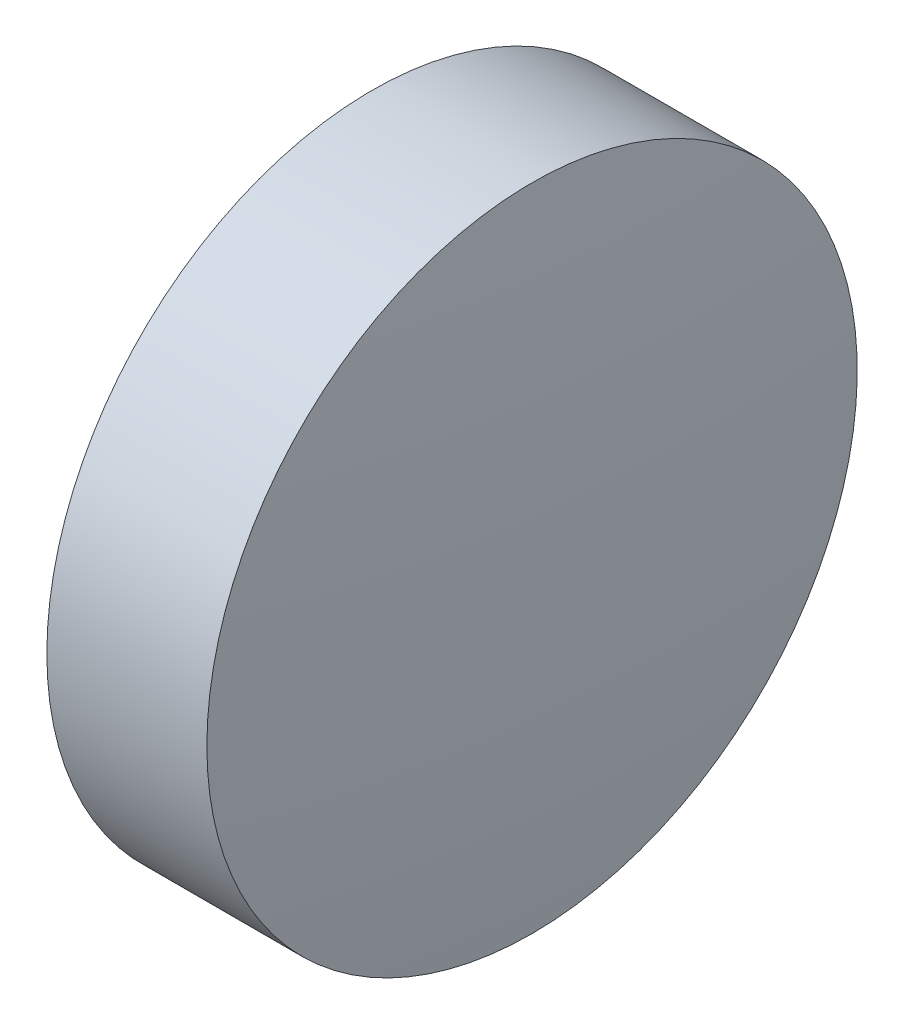
ISO-10303-21;
HEADER;
FILE_DESCRIPTION(('STEP AP214'),'2;1');
FILE_NAME('part.step','',(''),(''),'','','');
FILE_SCHEMA(('AUTOMOTIVE_DESIGN { 1 0 10303 214 1 1 1 1 }'));
ENDSEC;
DATA;
#1=APPLICATION_CONTEXT('core data for automotive mechanical design processes');
#2=APPLICATION_PROTOCOL_DEFINITION('international standard','automotive_design',2000,#1);
#3=PRODUCT_CONTEXT('',#1,'mechanical');
#4=PRODUCT('Part','Part','',(#3));
#5=PRODUCT_RELATED_PRODUCT_CATEGORY('part','',(#4));
#6=PRODUCT_DEFINITION_FORMATION('','',#4);
#7=PRODUCT_DEFINITION_CONTEXT('part definition',#1,'design');
#8=PRODUCT_DEFINITION('design','',#6,#7);
#9=PRODUCT_DEFINITION_SHAPE('','',#8);
#10=(LENGTH_UNIT() NAMED_UNIT(*) SI_UNIT(.MILLI.,.METRE.));
#11=(NAMED_UNIT(*) PLANE_ANGLE_UNIT() SI_UNIT($,.RADIAN.));
#12=(NAMED_UNIT(*) SI_UNIT($,.STERADIAN.) SOLID_ANGLE_UNIT());
#13=UNCERTAINTY_MEASURE_WITH_UNIT(LENGTH_MEASURE(1.E-05),#10,'distance_accuracy_value','');
#14=(GEOMETRIC_REPRESENTATION_CONTEXT(3) GLOBAL_UNCERTAINTY_ASSIGNED_CONTEXT((#13)) GLOBAL_UNIT_ASSIGNED_CONTEXT((#10,
#11,#12)) REPRESENTATION_CONTEXT('',''));
#15=CARTESIAN_POINT('',(0.,0.,0.));
#16=DIRECTION('',(0.,0.,1.));
#17=DIRECTION('',(1.,0.,0.));
#18=AXIS2_PLACEMENT_3D('',#15,#16,#17);
#19=CARTESIAN_POINT('',(454.378902488917,224.662621286379,0.));
#20=DIRECTION('',(-1.,0.,0.));
#21=DIRECTION('',(0.,-1.,0.));
#22=AXIS2_PLACEMENT_3D('',#19,#20,#21);
#23=SPHERICAL_SURFACE('',#22,33.15);
#24=CARTESIAN_POINT('',(487.378902488917,224.662621286379,0.));
#25=DIRECTION('',(-1.,0.,0.));
#26=DIRECTION('',(0.,0.,1.));
#27=AXIS2_PLACEMENT_3D('',#24,#25,#26);
#28=CIRCLE('',#27,3.15000000000001);
#29=CARTESIAN_POINT('',(487.378902488917,224.662621286379,3.15000000000001));
#30=VERTEX_POINT('',#29);
#31=EDGE_CURVE('E10',#30,#30,#28,.T.);
#32=ORIENTED_EDGE('',*,*,#31,.F.);
#33=EDGE_LOOP('',(#32));
#34=FACE_BOUND('',#33,.T.);
#35=ADVANCED_FACE('F35',(#34),#23,.T.);
#36=CARTESIAN_POINT('',(484.967274319333,224.662621286379,0.));
#37=DIRECTION('',(-1.,0.,0.));
#38=DIRECTION('',(0.,0.,1.));
#39=AXIS2_PLACEMENT_3D('',#36,#37,#38);
#40=CYLINDRICAL_SURFACE('',#39,3.15000000000001);
#41=CARTESIAN_POINT('',(485.828902488917,224.662621286379,0.));
#42=DIRECTION('',(-1.,0.,0.));
#43=DIRECTION('',(0.,0.,1.));
#44=AXIS2_PLACEMENT_3D('',#41,#42,#43);
#45=CIRCLE('',#44,3.15000000000001);
#46=CARTESIAN_POINT('',(485.828902488917,224.662621286379,3.15000000000001));
#47=VERTEX_POINT('',#46);
#48=EDGE_CURVE('E41',#47,#47,#45,.T.);
#49=ORIENTED_EDGE('',*,*,#48,.F.);
#50=EDGE_LOOP('',(#49));
#51=FACE_BOUND('',#50,.T.);
#52=ORIENTED_EDGE('',*,*,#31,.T.);
#53=EDGE_LOOP('',(#52));
#54=FACE_BOUND('',#53,.T.);
#55=ADVANCED_FACE('F49',(#51,#54),#40,.T.);
#56=CARTESIAN_POINT('',(485.828902488917,224.662621286379,0.));
#57=DIRECTION('',(1.,0.,0.));
#58=DIRECTION('',(0.,0.,-1.));
#59=AXIS2_PLACEMENT_3D('',#56,#57,#58);
#60=PLANE('',#59);
#61=ORIENTED_EDGE('',*,*,#48,.T.);
#62=EDGE_LOOP('',(#61));
#63=FACE_BOUND('',#62,.T.);
#64=ADVANCED_FACE('F47',(#63),#60,.F.);
#65=CLOSED_SHELL('',(#35,#55,#64));
#66=MANIFOLD_SOLID_BREP('B2',#65);
#67=ADVANCED_BREP_SHAPE_REPRESENTATION('',(#18,#66),#14);
#68=SHAPE_DEFINITION_REPRESENTATION(#9,#67);
ENDSEC;
END-ISO-10303-21;
